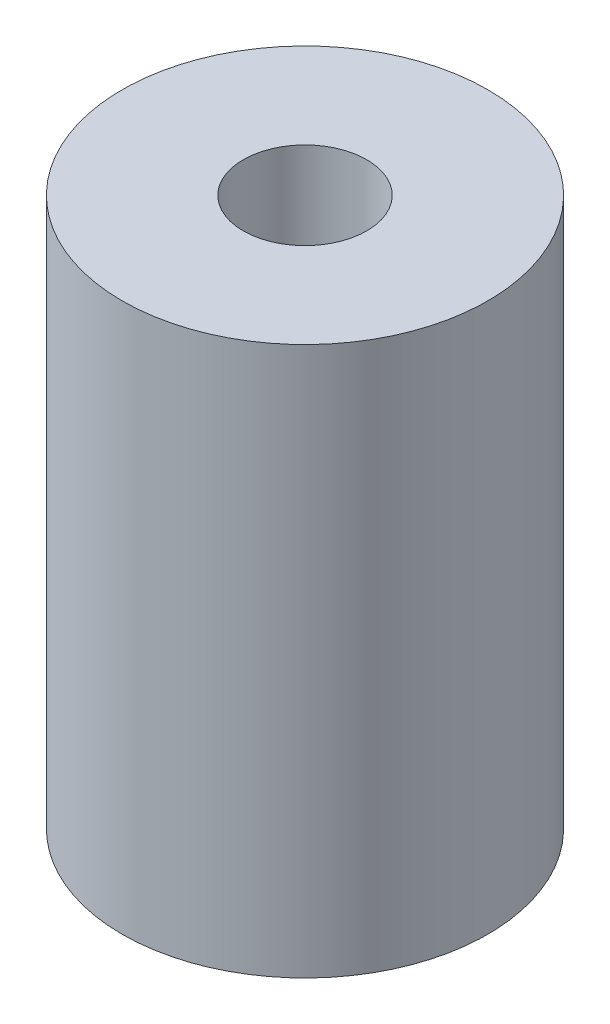
ISO-10303-21;
HEADER;
FILE_DESCRIPTION(('STEP AP214'),'2;1');
FILE_NAME('part.step','',(''),(''),'','','');
FILE_SCHEMA(('AUTOMOTIVE_DESIGN { 1 0 10303 214 1 1 1 1 }'));
ENDSEC;
DATA;
#1=APPLICATION_CONTEXT('core data for automotive mechanical design processes');
#2=APPLICATION_PROTOCOL_DEFINITION('international standard','automotive_design',2000,#1);
#3=PRODUCT_CONTEXT('',#1,'mechanical');
#4=PRODUCT('Part','Part','',(#3));
#5=PRODUCT_RELATED_PRODUCT_CATEGORY('part','',(#4));
#6=PRODUCT_DEFINITION_FORMATION('','',#4);
#7=PRODUCT_DEFINITION_CONTEXT('part definition',#1,'design');
#8=PRODUCT_DEFINITION('design','',#6,#7);
#9=PRODUCT_DEFINITION_SHAPE('','',#8);
#10=(LENGTH_UNIT() NAMED_UNIT(*) SI_UNIT(.MILLI.,.METRE.));
#11=(NAMED_UNIT(*) PLANE_ANGLE_UNIT() SI_UNIT($,.RADIAN.));
#12=(NAMED_UNIT(*) SI_UNIT($,.STERADIAN.) SOLID_ANGLE_UNIT());
#13=UNCERTAINTY_MEASURE_WITH_UNIT(LENGTH_MEASURE(1.E-05),#10,'distance_accuracy_value','');
#14=(GEOMETRIC_REPRESENTATION_CONTEXT(3) GLOBAL_UNCERTAINTY_ASSIGNED_CONTEXT((#13)) GLOBAL_UNIT_ASSIGNED_CONTEXT((#10,
#11,#12)) REPRESENTATION_CONTEXT('',''));
#15=CARTESIAN_POINT('',(0.,0.,0.));
#16=DIRECTION('',(0.,0.,1.));
#17=DIRECTION('',(1.,0.,0.));
#18=AXIS2_PLACEMENT_3D('',#15,#16,#17);
#19=CARTESIAN_POINT('',(0.,12.,0.));
#20=DIRECTION('',(0.,1.,0.));
#21=DIRECTION('',(0.,0.,1.));
#22=AXIS2_PLACEMENT_3D('',#19,#20,#21);
#23=PLANE('',#22);
#24=CARTESIAN_POINT('',(0.,12.,0.));
#25=DIRECTION('',(0.,1.,0.));
#26=DIRECTION('',(0.,0.,1.));
#27=AXIS2_PLACEMENT_3D('',#24,#25,#26);
#28=CIRCLE('',#27,4.);
#29=CARTESIAN_POINT('',(0.,12.,4.));
#30=VERTEX_POINT('',#29);
#31=EDGE_CURVE('E10',#30,#30,#28,.T.);
#32=ORIENTED_EDGE('',*,*,#31,.T.);
#33=EDGE_LOOP('',(#32));
#34=FACE_BOUND('',#33,.T.);
#35=CARTESIAN_POINT('',(0.,12.,0.));
#36=DIRECTION('',(0.,1.,0.));
#37=DIRECTION('',(0.,0.,1.));
#38=AXIS2_PLACEMENT_3D('',#35,#36,#37);
#39=CIRCLE('',#38,1.35);
#40=CARTESIAN_POINT('',(0.,12.,1.35));
#41=VERTEX_POINT('',#40);
#42=EDGE_CURVE('E42',#41,#41,#39,.T.);
#43=ORIENTED_EDGE('',*,*,#42,.F.);
#44=EDGE_LOOP('',(#43));
#45=FACE_BOUND('',#44,.T.);
#46=ADVANCED_FACE('F31',(#34,#45),#23,.T.);
#47=CARTESIAN_POINT('',(0.,0.,0.));
#48=DIRECTION('',(0.,1.,0.));
#49=DIRECTION('',(0.,0.,1.));
#50=AXIS2_PLACEMENT_3D('',#47,#48,#49);
#51=PLANE('',#50);
#52=CARTESIAN_POINT('',(0.,0.,0.));
#53=DIRECTION('',(0.,1.,0.));
#54=DIRECTION('',(0.,0.,1.));
#55=AXIS2_PLACEMENT_3D('',#52,#53,#54);
#56=CIRCLE('',#55,4.);
#57=CARTESIAN_POINT('',(0.,0.,4.));
#58=VERTEX_POINT('',#57);
#59=EDGE_CURVE('E35',#58,#58,#56,.T.);
#60=ORIENTED_EDGE('',*,*,#59,.F.);
#61=EDGE_LOOP('',(#60));
#62=FACE_BOUND('',#61,.T.);
#63=CARTESIAN_POINT('',(0.,0.,0.));
#64=DIRECTION('',(0.,1.,0.));
#65=DIRECTION('',(0.,0.,1.));
#66=AXIS2_PLACEMENT_3D('',#63,#64,#65);
#67=CIRCLE('',#66,1.35);
#68=CARTESIAN_POINT('',(0.,0.,1.35));
#69=VERTEX_POINT('',#68);
#70=EDGE_CURVE('E44',#69,#69,#67,.T.);
#71=ORIENTED_EDGE('',*,*,#70,.T.);
#72=EDGE_LOOP('',(#71));
#73=FACE_BOUND('',#72,.T.);
#74=ADVANCED_FACE('F54',(#62,#73),#51,.F.);
#75=CARTESIAN_POINT('',(0.,12.,0.));
#76=DIRECTION('',(0.,-1.,0.));
#77=DIRECTION('',(0.,0.,-1.));
#78=AXIS2_PLACEMENT_3D('',#75,#76,#77);
#79=CYLINDRICAL_SURFACE('',#78,4.);
#80=ORIENTED_EDGE('',*,*,#31,.F.);
#81=EDGE_LOOP('',(#80));
#82=FACE_BOUND('',#81,.T.);
#83=ORIENTED_EDGE('',*,*,#59,.T.);
#84=EDGE_LOOP('',(#83));
#85=FACE_BOUND('',#84,.T.);
#86=ADVANCED_FACE('F33',(#82,#85),#79,.T.);
#87=CARTESIAN_POINT('',(0.,12.,0.));
#88=DIRECTION('',(0.,-1.,0.));
#89=DIRECTION('',(0.,0.,-1.));
#90=AXIS2_PLACEMENT_3D('',#87,#88,#89);
#91=CYLINDRICAL_SURFACE('',#90,1.35);
#92=ORIENTED_EDGE('',*,*,#42,.T.);
#93=EDGE_LOOP('',(#92));
#94=FACE_BOUND('',#93,.T.);
#95=ORIENTED_EDGE('',*,*,#70,.F.);
#96=EDGE_LOOP('',(#95));
#97=FACE_BOUND('',#96,.T.);
#98=ADVANCED_FACE('F50',(#94,#97),#91,.F.);
#99=CLOSED_SHELL('',(#46,#74,#86,#98));
#100=MANIFOLD_SOLID_BREP('B2',#99);
#101=ADVANCED_BREP_SHAPE_REPRESENTATION('',(#18,#100),#14);
#102=SHAPE_DEFINITION_REPRESENTATION(#9,#101);
ENDSEC;
END-ISO-10303-21;
